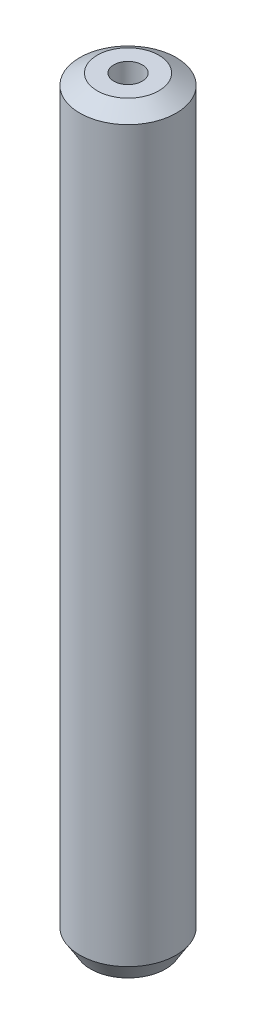
ISO-10303-21;
HEADER;
FILE_DESCRIPTION(('STEP AP214'),'2;1');
FILE_NAME('part.step','',(''),(''),'','','');
FILE_SCHEMA(('AUTOMOTIVE_DESIGN { 1 0 10303 214 1 1 1 1 }'));
ENDSEC;
DATA;
#1=APPLICATION_CONTEXT('core data for automotive mechanical design processes');
#2=APPLICATION_PROTOCOL_DEFINITION('international standard','automotive_design',2000,#1);
#3=PRODUCT_CONTEXT('',#1,'mechanical');
#4=PRODUCT('Part','Part','',(#3));
#5=PRODUCT_RELATED_PRODUCT_CATEGORY('part','',(#4));
#6=PRODUCT_DEFINITION_FORMATION('','',#4);
#7=PRODUCT_DEFINITION_CONTEXT('part definition',#1,'design');
#8=PRODUCT_DEFINITION('design','',#6,#7);
#9=PRODUCT_DEFINITION_SHAPE('','',#8);
#10=(LENGTH_UNIT() NAMED_UNIT(*) SI_UNIT(.MILLI.,.METRE.));
#11=(NAMED_UNIT(*) PLANE_ANGLE_UNIT() SI_UNIT($,.RADIAN.));
#12=(NAMED_UNIT(*) SI_UNIT($,.STERADIAN.) SOLID_ANGLE_UNIT());
#13=UNCERTAINTY_MEASURE_WITH_UNIT(LENGTH_MEASURE(1.E-05),#10,'distance_accuracy_value','');
#14=(GEOMETRIC_REPRESENTATION_CONTEXT(3) GLOBAL_UNCERTAINTY_ASSIGNED_CONTEXT((#13)) GLOBAL_UNIT_ASSIGNED_CONTEXT((#10,
#11,#12)) REPRESENTATION_CONTEXT('',''));
#15=CARTESIAN_POINT('',(0.,0.,0.));
#16=DIRECTION('',(0.,0.,1.));
#17=DIRECTION('',(1.,0.,0.));
#18=AXIS2_PLACEMENT_3D('',#15,#16,#17);
#19=CARTESIAN_POINT('',(0.,196.355624658388,0.));
#20=DIRECTION('',(0.,-1.,0.));
#21=DIRECTION('',(0.,0.,-1.));
#22=AXIS2_PLACEMENT_3D('',#19,#20,#21);
#23=CYLINDRICAL_SURFACE('',#22,12.5);
#24=CARTESIAN_POINT('',(0.,193.586735673122,0.));
#25=DIRECTION('',(0.,1.,0.));
#26=DIRECTION('',(0.,0.,1.));
#27=AXIS2_PLACEMENT_3D('',#24,#25,#26);
#28=CIRCLE('',#27,12.5);
#29=CARTESIAN_POINT('',(0.,193.586735673122,-12.5));
#30=VERTEX_POINT('',#29);
#31=EDGE_CURVE('E50',#30,#30,#28,.F.);
#32=CARTESIAN_POINT('',(0.,4.50267205597993,0.));
#33=DIRECTION('',(0.,1.,0.));
#34=DIRECTION('',(0.,0.,1.));
#35=AXIS2_PLACEMENT_3D('',#32,#33,#34);
#36=CIRCLE('',#35,12.5);
#37=CARTESIAN_POINT('',(0.,4.5026720559799,-12.5));
#38=VERTEX_POINT('',#37);
#39=EDGE_CURVE('E51',#38,#38,#36,.T.);
#40=CARTESIAN_POINT('',(0.,193.586735673122,-12.5));
#41=CARTESIAN_POINT('',(0.,191.617110010443,-12.5));
#42=CARTESIAN_POINT('',(0.,189.647484347765,-12.5));
#43=CARTESIAN_POINT('',(0.,185.708233022407,-12.5));
#44=CARTESIAN_POINT('',(0.,183.738607359729,-12.5));
#45=CARTESIAN_POINT('',(0.,179.799356034372,-12.5));
#46=CARTESIAN_POINT('',(0.,177.829730371693,-12.5));
#47=CARTESIAN_POINT('',(0.,173.890479046336,-12.5));
#48=CARTESIAN_POINT('',(0.,171.920853383657,-12.5));
#49=CARTESIAN_POINT('',(0.,167.9816020583,-12.5));
#50=CARTESIAN_POINT('',(0.,166.011976395622,-12.5));
#51=CARTESIAN_POINT('',(0.,162.072725070265,-12.5));
#52=CARTESIAN_POINT('',(0.,160.103099407586,-12.5));
#53=CARTESIAN_POINT('',(0.,156.163848082229,-12.5));
#54=CARTESIAN_POINT('',(0.,154.19422241955,-12.5));
#55=CARTESIAN_POINT('',(0.,150.254971094193,-12.5));
#56=CARTESIAN_POINT('',(0.,148.285345431515,-12.5));
#57=CARTESIAN_POINT('',(0.,144.346094106158,-12.5));
#58=CARTESIAN_POINT('',(0.,142.376468443479,-12.5));
#59=CARTESIAN_POINT('',(0.,138.437217118122,-12.5));
#60=CARTESIAN_POINT('',(0.,136.467591455443,-12.5));
#61=CARTESIAN_POINT('',(0.,132.528340130086,-12.5));
#62=CARTESIAN_POINT('',(0.,130.558714467408,-12.5));
#63=CARTESIAN_POINT('',(0.,126.619463142051,-12.5));
#64=CARTESIAN_POINT('',(0.,124.649837479372,-12.5));
#65=CARTESIAN_POINT('',(0.,120.710586154015,-12.5));
#66=CARTESIAN_POINT('',(0.,118.740960491336,-12.5));
#67=CARTESIAN_POINT('',(0.,114.801709165979,-12.5));
#68=CARTESIAN_POINT('',(0.,112.832083503301,-12.5));
#69=CARTESIAN_POINT('',(0.,108.892832177944,-12.5));
#70=CARTESIAN_POINT('',(0.,106.923206515265,-12.5));
#71=CARTESIAN_POINT('',(0.,102.983955189908,-12.5));
#72=CARTESIAN_POINT('',(0.,101.014329527229,-12.5));
#73=CARTESIAN_POINT('',(0.,97.0750782018722,-12.5));
#74=CARTESIAN_POINT('',(0.,95.1054525391936,-12.5));
#75=CARTESIAN_POINT('',(0.,91.1662012138365,-12.5));
#76=CARTESIAN_POINT('',(0.,89.196575551158,-12.5));
#77=CARTESIAN_POINT('',(0.,85.2573242258009,-12.5));
#78=CARTESIAN_POINT('',(0.,83.2876985631223,-12.5));
#79=CARTESIAN_POINT('',(0.,79.3484472377652,-12.5));
#80=CARTESIAN_POINT('',(0.,77.3788215750866,-12.5));
#81=CARTESIAN_POINT('',(0.,73.4395702497295,-12.5));
#82=CARTESIAN_POINT('',(0.,71.4699445870509,-12.5));
#83=CARTESIAN_POINT('',(0.,67.5306932616938,-12.5));
#84=CARTESIAN_POINT('',(0.,65.5610675990153,-12.5));
#85=CARTESIAN_POINT('',(0.,61.6218162736582,-12.5));
#86=CARTESIAN_POINT('',(0.,59.6521906109796,-12.5));
#87=CARTESIAN_POINT('',(0.,55.7129392856225,-12.5));
#88=CARTESIAN_POINT('',(0.,53.7433136229439,-12.5));
#89=CARTESIAN_POINT('',(0.,49.8040622975868,-12.5));
#90=CARTESIAN_POINT('',(0.,47.8344366349082,-12.5));
#91=CARTESIAN_POINT('',(0.,43.8951853095511,-12.5));
#92=CARTESIAN_POINT('',(0.,41.9255596468725,-12.5));
#93=CARTESIAN_POINT('',(0.,37.9863083215154,-12.5));
#94=CARTESIAN_POINT('',(0.,36.0166826588369,-12.5));
#95=CARTESIAN_POINT('',(0.,32.0774313334798,-12.5));
#96=CARTESIAN_POINT('',(0.,30.1078056708012,-12.5));
#97=CARTESIAN_POINT('',(0.,26.1685543454441,-12.5));
#98=CARTESIAN_POINT('',(0.,24.1989286827655,-12.5));
#99=CARTESIAN_POINT('',(0.,20.2596773574084,-12.5));
#100=CARTESIAN_POINT('',(0.,18.2900516947298,-12.5));
#101=CARTESIAN_POINT('',(0.,14.3508003693727,-12.5));
#102=CARTESIAN_POINT('',(0.,12.3811747066942,-12.5));
#103=CARTESIAN_POINT('',(0.,8.44192338133705,-12.5));
#104=CARTESIAN_POINT('',(0.,6.47229771865848,-12.5));
#105=CARTESIAN_POINT('',(0.,4.5026720559799,-12.5));
#106=B_SPLINE_CURVE_WITH_KNOTS('',3,(#40,#41,#42,#43,#44,#45,#46,#47,#48,#49,#50,#51,#52,#53,
#54,#55,#56,#57,#58,#59,#60,#61,#62,#63,#64,#65,#66,#67,#68,#69,#70,#71,#72,#73,#74,#75,#76,#77,
#78,#79,#80,#81,#82,#83,#84,#85,#86,#87,#88,#89,#90,#91,#92,#93,#94,#95,#96,#97,#98,#99,#100,
#101,#102,#103,#104,#105),.UNSPECIFIED.,.F.,.F.,(4,2,2,2,2,2,2,2,2,2,2,2,2,2,2,2,2,2,2,2,2,2,2,
2,2,2,2,2,2,2,2,2,4),(0.,5.90887698803569,11.8177539760714,17.726630964107,23.6355079521427,
29.5443849401784,35.4532619282141,41.3621389162498,47.2710159042854,53.1798928923211,
59.0887698803568,64.9976468683925,70.9065238564282,76.8154008444638,82.7242778324995,
88.6331548205352,94.5420318085709,100.450908796607,106.359785784642,112.268662772678,
118.177539760714,124.086416748749,129.995293736785,135.904170724821,141.813047712856,
147.721924700892,153.630801688928,159.539678676963,165.448555664999,171.357432653035,
177.26630964107,183.175186629106,189.084063617142),.UNSPECIFIED.);
#107=EDGE_CURVE('BSEAM39',#30,#38,#106,.T.);
#108=ORIENTED_EDGE('',*,*,#31,.T.);
#109=ORIENTED_EDGE('',*,*,#39,.T.);
#110=ORIENTED_EDGE('',*,*,#107,.T.);
#111=ORIENTED_EDGE('',*,*,#107,.F.);
#112=EDGE_LOOP('',(#108,#110,#109,#111));
#113=FACE_BOUND('',#112,.T.);
#114=ADVANCED_FACE('F39',(#113),#23,.T.);
#115=CARTESIAN_POINT('',(0.,196.355624658388,0.));
#116=DIRECTION('',(0.,1.,0.));
#117=DIRECTION('',(0.,0.,1.));
#118=AXIS2_PLACEMENT_3D('',#115,#116,#117);
#119=PLANE('',#118);
#120=CARTESIAN_POINT('',(0.,196.355624658388,0.));
#121=DIRECTION('',(0.,1.,0.));
#122=DIRECTION('',(0.,0.,1.));
#123=AXIS2_PLACEMENT_3D('',#120,#121,#122);
#124=CIRCLE('',#123,7.99732794402061);
#125=CARTESIAN_POINT('',(0.,196.355624658388,7.99732794402061));
#126=VERTEX_POINT('',#125);
#127=EDGE_CURVE('E54',#126,#126,#124,.T.);
#128=ORIENTED_EDGE('',*,*,#127,.T.);
#129=EDGE_LOOP('',(#128));
#130=FACE_BOUND('',#129,.T.);
#131=CARTESIAN_POINT('',(0.,196.355624658388,0.));
#132=DIRECTION('',(0.,1.,0.));
#133=DIRECTION('',(0.,0.,1.));
#134=AXIS2_PLACEMENT_3D('',#131,#132,#133);
#135=CIRCLE('',#134,3.6906820419112);
#136=CARTESIAN_POINT('',(0.,196.355624658388,-3.6906820419112));
#137=VERTEX_POINT('',#136);
#138=EDGE_CURVE('E58',#137,#137,#135,.T.);
#139=ORIENTED_EDGE('',*,*,#138,.F.);
#140=EDGE_LOOP('',(#139));
#141=FACE_BOUND('',#140,.T.);
#142=ADVANCED_FACE('F69',(#130,#141),#119,.T.);
#143=CARTESIAN_POINT('',(0.,0.,0.));
#144=DIRECTION('',(0.,1.,0.));
#145=DIRECTION('',(0.,0.,1.));
#146=AXIS2_PLACEMENT_3D('',#143,#144,#145);
#147=PLANE('',#146);
#148=CARTESIAN_POINT('',(0.,0.,0.));
#149=DIRECTION('',(0.,1.,0.));
#150=DIRECTION('',(0.,0.,1.));
#151=AXIS2_PLACEMENT_3D('',#148,#149,#150);
#152=CIRCLE('',#151,9.73111101473291);
#153=CARTESIAN_POINT('',(0.,0.,9.73111101473291));
#154=VERTEX_POINT('',#153);
#155=EDGE_CURVE('E10',#154,#154,#152,.F.);
#156=ORIENTED_EDGE('',*,*,#155,.T.);
#157=EDGE_LOOP('',(#156));
#158=FACE_BOUND('',#157,.T.);
#159=CARTESIAN_POINT('',(0.,0.,0.));
#160=DIRECTION('',(0.,1.,0.));
#161=DIRECTION('',(0.,0.,1.));
#162=AXIS2_PLACEMENT_3D('',#159,#160,#161);
#163=CIRCLE('',#162,3.6906820419112);
#164=CARTESIAN_POINT('',(0.,0.,-3.6906820419112));
#165=VERTEX_POINT('',#164);
#166=EDGE_CURVE('E63',#165,#165,#163,.T.);
#167=ORIENTED_EDGE('',*,*,#166,.T.);
#168=EDGE_LOOP('',(#167));
#169=FACE_BOUND('',#168,.T.);
#170=ADVANCED_FACE('F75',(#158,#169),#147,.F.);
#171=CARTESIAN_POINT('',(0.,196.355624658388,0.));
#172=DIRECTION('',(0.,-1.,0.));
#173=DIRECTION('',(0.,0.,-1.));
#174=AXIS2_PLACEMENT_3D('',#171,#172,#173);
#175=CYLINDRICAL_SURFACE('',#174,3.6906820419112);
#176=CARTESIAN_POINT('',(0.,196.355624658388,-3.6906820419112));
#177=CARTESIAN_POINT('',(0.,194.310253568197,-3.6906820419112));
#178=CARTESIAN_POINT('',(0.,192.264882478005,-3.6906820419112));
#179=CARTESIAN_POINT('',(0.,188.174140297622,-3.6906820419112));
#180=CARTESIAN_POINT('',(0.,186.128769207431,-3.6906820419112));
#181=CARTESIAN_POINT('',(0.,182.038027027048,-3.6906820419112));
#182=CARTESIAN_POINT('',(0.,179.992655936856,-3.6906820419112));
#183=CARTESIAN_POINT('',(0.,175.901913756473,-3.6906820419112));
#184=CARTESIAN_POINT('',(0.,173.856542666281,-3.6906820419112));
#185=CARTESIAN_POINT('',(0.,169.765800485898,-3.6906820419112));
#186=CARTESIAN_POINT('',(0.,167.720429395707,-3.6906820419112));
#187=CARTESIAN_POINT('',(0.,163.629687215324,-3.6906820419112));
#188=CARTESIAN_POINT('',(0.,161.584316125132,-3.6906820419112));
#189=CARTESIAN_POINT('',(0.,157.493573944749,-3.6906820419112));
#190=CARTESIAN_POINT('',(0.,155.448202854557,-3.6906820419112));
#191=CARTESIAN_POINT('',(0.,151.357460674174,-3.6906820419112));
#192=CARTESIAN_POINT('',(0.,149.312089583983,-3.6906820419112));
#193=CARTESIAN_POINT('',(0.,145.2213474036,-3.6906820419112));
#194=CARTESIAN_POINT('',(0.,143.175976313408,-3.6906820419112));
#195=CARTESIAN_POINT('',(0.,139.085234133025,-3.6906820419112));
#196=CARTESIAN_POINT('',(0.,137.039863042834,-3.6906820419112));
#197=CARTESIAN_POINT('',(0.,132.94912086245,-3.6906820419112));
#198=CARTESIAN_POINT('',(0.,130.903749772259,-3.6906820419112));
#199=CARTESIAN_POINT('',(0.,126.813007591876,-3.6906820419112));
#200=CARTESIAN_POINT('',(0.,124.767636501684,-3.6906820419112));
#201=CARTESIAN_POINT('',(0.,120.676894321301,-3.6906820419112));
#202=CARTESIAN_POINT('',(0.,118.63152323111,-3.6906820419112));
#203=CARTESIAN_POINT('',(0.,114.540781050727,-3.6906820419112));
#204=CARTESIAN_POINT('',(0.,112.495409960535,-3.6906820419112));
#205=CARTESIAN_POINT('',(0.,108.404667780152,-3.6906820419112));
#206=CARTESIAN_POINT('',(0.,106.35929668996,-3.6906820419112));
#207=CARTESIAN_POINT('',(0.,102.268554509577,-3.6906820419112));
#208=CARTESIAN_POINT('',(0.,100.223183419386,-3.6906820419112));
#209=CARTESIAN_POINT('',(0.,96.1324412390026,-3.6906820419112));
#210=CARTESIAN_POINT('',(0.,94.0870701488111,-3.6906820419112));
#211=CARTESIAN_POINT('',(0.,89.996327968428,-3.6906820419112));
#212=CARTESIAN_POINT('',(0.,87.9509568782364,-3.6906820419112));
#213=CARTESIAN_POINT('',(0.,83.8602146978534,-3.6906820419112));
#214=CARTESIAN_POINT('',(0.,81.8148436076618,-3.6906820419112));
#215=CARTESIAN_POINT('',(0.,77.7241014272787,-3.6906820419112));
#216=CARTESIAN_POINT('',(0.,75.6787303370872,-3.6906820419112));
#217=CARTESIAN_POINT('',(0.,71.5879881567041,-3.6906820419112));
#218=CARTESIAN_POINT('',(0.,69.5426170665125,-3.6906820419112));
#219=CARTESIAN_POINT('',(0.,65.4518748861295,-3.6906820419112));
#220=CARTESIAN_POINT('',(0.,63.4065037959379,-3.6906820419112));
#221=CARTESIAN_POINT('',(0.,59.3157616155548,-3.6906820419112));
#222=CARTESIAN_POINT('',(0.,57.2703905253633,-3.6906820419112));
#223=CARTESIAN_POINT('',(0.,53.1796483449802,-3.6906820419112));
#224=CARTESIAN_POINT('',(0.,51.1342772547886,-3.6906820419112));
#225=CARTESIAN_POINT('',(0.,47.0435350744055,-3.6906820419112));
#226=CARTESIAN_POINT('',(0.,44.998163984214,-3.6906820419112));
#227=CARTESIAN_POINT('',(0.,40.9074218038309,-3.6906820419112));
#228=CARTESIAN_POINT('',(0.,38.8620507136394,-3.6906820419112));
#229=CARTESIAN_POINT('',(0.,34.7713085332563,-3.6906820419112));
#230=CARTESIAN_POINT('',(0.,32.7259374430647,-3.6906820419112));
#231=CARTESIAN_POINT('',(0.,28.6351952626816,-3.6906820419112));
#232=CARTESIAN_POINT('',(0.,26.5898241724901,-3.6906820419112));
#233=CARTESIAN_POINT('',(0.,22.499081992107,-3.6906820419112));
#234=CARTESIAN_POINT('',(0.,20.4537109019154,-3.6906820419112));
#235=CARTESIAN_POINT('',(0.,16.3629687215323,-3.6906820419112));
#236=CARTESIAN_POINT('',(0.,14.3175976313408,-3.6906820419112));
#237=CARTESIAN_POINT('',(0.,10.2268554509577,-3.6906820419112));
#238=CARTESIAN_POINT('',(0.,8.18148436076616,-3.6906820419112));
#239=CARTESIAN_POINT('',(0.,4.09074218038307,-3.6906820419112));
#240=CARTESIAN_POINT('',(0.,2.04537109019152,-3.6906820419112));
#241=CARTESIAN_POINT('',(0.,0.,-3.6906820419112));
#242=B_SPLINE_CURVE_WITH_KNOTS('',3,(#176,#177,#178,#179,#180,#181,#182,#183,#184,#185,#186,
#187,#188,#189,#190,#191,#192,#193,#194,#195,#196,#197,#198,#199,#200,#201,#202,#203,#204,#205,
#206,#207,#208,#209,#210,#211,#212,#213,#214,#215,#216,#217,#218,#219,#220,#221,#222,#223,#224,
#225,#226,#227,#228,#229,#230,#231,#232,#233,#234,#235,#236,#237,#238,#239,#240,#241),
.UNSPECIFIED.,.F.,.F.,(4,2,2,2,2,2,2,2,2,2,2,2,2,2,2,2,2,2,2,2,2,2,2,2,2,2,2,2,2,2,2,2,4),(0.,
6.13611327057464,12.2722265411493,18.4083398117239,24.5444530822986,30.6805663528732,
36.8166796234478,42.9527928940225,49.0889061645971,55.2250194351718,61.3611327057464,
67.497245976321,73.6333592468957,79.7694725174703,85.905585788045,92.0416990586196,
98.1778123291942,104.313925599769,110.450038870344,116.586152140918,122.722265411493,
128.858378682067,134.994491952642,141.130605223217,147.266718493791,153.402831764366,
159.538945034941,165.675058305515,171.81117157609,177.947284846665,184.083398117239,
190.219511387814,196.355624658388),.UNSPECIFIED.);
#243=EDGE_CURVE('BSEAM70',#137,#165,#242,.T.);
#244=ORIENTED_EDGE('',*,*,#138,.T.);
#245=ORIENTED_EDGE('',*,*,#166,.F.);
#246=ORIENTED_EDGE('',*,*,#243,.T.);
#247=ORIENTED_EDGE('',*,*,#243,.F.);
#248=EDGE_LOOP('',(#244,#246,#245,#247));
#249=FACE_BOUND('',#248,.T.);
#250=ADVANCED_FACE('F70',(#249),#175,.F.);
#251=CARTESIAN_POINT('',(0.,196.355624658388,0.));
#252=DIRECTION('',(0.,-1.,0.));
#253=DIRECTION('',(0.,0.,-1.));
#254=AXIS2_PLACEMENT_3D('',#251,#252,#253);
#255=CONICAL_SURFACE('',#254,7.99732794402061,1.01946134633525);
#256=ORIENTED_EDGE('',*,*,#31,.F.);
#257=EDGE_LOOP('',(#256));
#258=FACE_BOUND('',#257,.T.);
#259=ORIENTED_EDGE('',*,*,#127,.F.);
#260=EDGE_LOOP('',(#259));
#261=FACE_BOUND('',#260,.T.);
#262=ADVANCED_FACE('F81',(#258,#261),#255,.T.);
#263=CARTESIAN_POINT('',(0.,4.50267205597993,0.));
#264=DIRECTION('',(0.,1.,0.));
#265=DIRECTION('',(0.,0.,1.));
#266=AXIS2_PLACEMENT_3D('',#263,#264,#265);
#267=CONICAL_SURFACE('',#266,12.5,0.551334980459649);
#268=ORIENTED_EDGE('',*,*,#155,.F.);
#269=EDGE_LOOP('',(#268));
#270=FACE_BOUND('',#269,.T.);
#271=ORIENTED_EDGE('',*,*,#39,.F.);
#272=EDGE_LOOP('',(#271));
#273=FACE_BOUND('',#272,.T.);
#274=ADVANCED_FACE('F45',(#270,#273),#267,.T.);
#275=CLOSED_SHELL('',(#114,#142,#170,#250,#262,#274));
#276=MANIFOLD_SOLID_BREP('B2',#275);
#277=ADVANCED_BREP_SHAPE_REPRESENTATION('',(#18,#276),#14);
#278=SHAPE_DEFINITION_REPRESENTATION(#9,#277);
ENDSEC;
END-ISO-10303-21;
